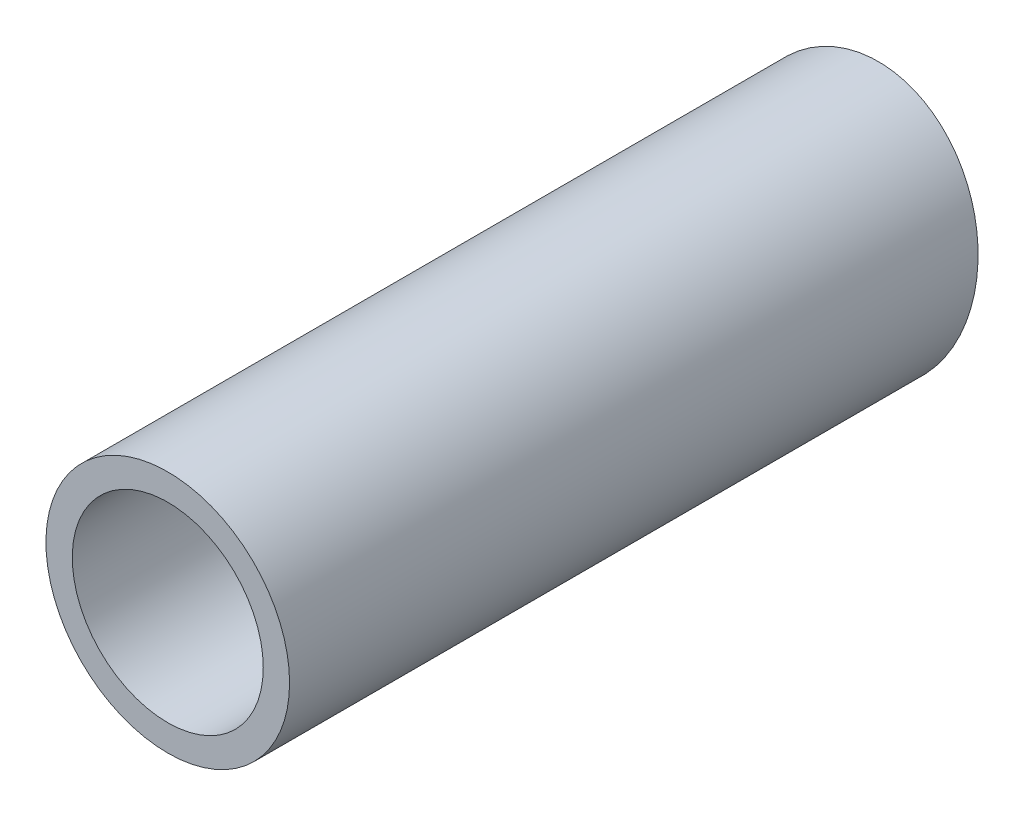
ISO-10303-21;
HEADER;
FILE_DESCRIPTION(('STEP AP214'),'2;1');
FILE_NAME('part.step','',(''),(''),'','','');
FILE_SCHEMA(('AUTOMOTIVE_DESIGN { 1 0 10303 214 1 1 1 1 }'));
ENDSEC;
DATA;
#1=APPLICATION_CONTEXT('core data for automotive mechanical design processes');
#2=APPLICATION_PROTOCOL_DEFINITION('international standard','automotive_design',2000,#1);
#3=PRODUCT_CONTEXT('',#1,'mechanical');
#4=PRODUCT('Part','Part','',(#3));
#5=PRODUCT_RELATED_PRODUCT_CATEGORY('part','',(#4));
#6=PRODUCT_DEFINITION_FORMATION('','',#4);
#7=PRODUCT_DEFINITION_CONTEXT('part definition',#1,'design');
#8=PRODUCT_DEFINITION('design','',#6,#7);
#9=PRODUCT_DEFINITION_SHAPE('','',#8);
#10=(LENGTH_UNIT() NAMED_UNIT(*) SI_UNIT(.MILLI.,.METRE.));
#11=(NAMED_UNIT(*) PLANE_ANGLE_UNIT() SI_UNIT($,.RADIAN.));
#12=(NAMED_UNIT(*) SI_UNIT($,.STERADIAN.) SOLID_ANGLE_UNIT());
#13=UNCERTAINTY_MEASURE_WITH_UNIT(LENGTH_MEASURE(1.E-05),#10,'distance_accuracy_value','');
#14=(GEOMETRIC_REPRESENTATION_CONTEXT(3) GLOBAL_UNCERTAINTY_ASSIGNED_CONTEXT((#13)) GLOBAL_UNIT_ASSIGNED_CONTEXT((#10,
#11,#12)) REPRESENTATION_CONTEXT('',''));
#15=CARTESIAN_POINT('',(0.,0.,0.));
#16=DIRECTION('',(0.,0.,1.));
#17=DIRECTION('',(1.,0.,0.));
#18=AXIS2_PLACEMENT_3D('',#15,#16,#17);
#19=CARTESIAN_POINT('',(0.,0.,60.));
#20=DIRECTION('',(0.,0.,1.));
#21=DIRECTION('',(1.,0.,0.));
#22=AXIS2_PLACEMENT_3D('',#19,#20,#21);
#23=PLANE('',#22);
#24=CARTESIAN_POINT('',(0.,0.,60.));
#25=DIRECTION('',(0.,0.,-1.));
#26=DIRECTION('',(-1.,0.,0.));
#27=AXIS2_PLACEMENT_3D('',#24,#25,#26);
#28=CIRCLE('',#27,10.65);
#29=CARTESIAN_POINT('',(10.65,0.,60.));
#30=VERTEX_POINT('',#29);
#31=EDGE_CURVE('E11',#30,#30,#28,.T.);
#32=ORIENTED_EDGE('',*,*,#31,.F.);
#33=EDGE_LOOP('',(#32));
#34=FACE_BOUND('',#33,.T.);
#35=CARTESIAN_POINT('',(0.,0.,60.));
#36=DIRECTION('',(0.,0.,1.));
#37=DIRECTION('',(-1.,0.,0.));
#38=AXIS2_PLACEMENT_3D('',#35,#36,#37);
#39=CIRCLE('',#38,8.35);
#40=CARTESIAN_POINT('',(8.35,0.,60.));
#41=VERTEX_POINT('',#40);
#42=EDGE_CURVE('E26',#41,#41,#39,.T.);
#43=ORIENTED_EDGE('',*,*,#42,.F.);
#44=EDGE_LOOP('',(#43));
#45=FACE_BOUND('',#44,.T.);
#46=ADVANCED_FACE('F16',(#34,#45),#23,.T.);
#47=CARTESIAN_POINT('',(0.,0.,0.));
#48=DIRECTION('',(0.,0.,1.));
#49=DIRECTION('',(-1.,0.,0.));
#50=AXIS2_PLACEMENT_3D('',#47,#48,#49);
#51=CYLINDRICAL_SURFACE('',#50,10.65);
#52=ORIENTED_EDGE('',*,*,#31,.T.);
#53=EDGE_LOOP('',(#52));
#54=FACE_BOUND('',#53,.T.);
#55=CARTESIAN_POINT('',(0.,0.,0.00404325115347778));
#56=DIRECTION('',(-0.000990516549095599,0.196301111783344,0.980543161920774));
#57=DIRECTION('',(-0.00494766359651267,0.980530679282665,-0.196303610793105));
#58=AXIS2_PLACEMENT_3D('',#55,#56,#57);
#59=ELLIPSE('',#58,10.8613270823671,10.65);
#60=CARTESIAN_POINT('',(0.0537381926152463,-10.6498644219847,2.13616097542709));
#61=VERTEX_POINT('',#60);
#62=EDGE_CURVE('E54',#61,#61,#59,.T.);
#63=ORIENTED_EDGE('',*,*,#62,.T.);
#64=EDGE_LOOP('',(#63));
#65=FACE_BOUND('',#64,.T.);
#66=ADVANCED_FACE('F91',(#54,#65),#51,.T.);
#67=CARTESIAN_POINT('',(0.,0.,0.));
#68=DIRECTION('',(0.,0.,1.));
#69=DIRECTION('',(-1.,0.,0.));
#70=AXIS2_PLACEMENT_3D('',#67,#68,#69);
#71=CYLINDRICAL_SURFACE('',#70,8.35);
#72=ORIENTED_EDGE('',*,*,#42,.T.);
#73=EDGE_LOOP('',(#72));
#74=FACE_BOUND('',#73,.T.);
#75=CARTESIAN_POINT('',(0.,0.,0.00404325115347778));
#76=DIRECTION('',(0.000990516549095599,-0.196301111783344,-0.980543161920774));
#77=DIRECTION('',(-0.00494766359651267,0.980530679282665,-0.196303610793105));
#78=AXIS2_PLACEMENT_3D('',#75,#76,#77);
#79=ELLIPSE('',#78,8.51568836974325,8.35);
#80=CARTESIAN_POINT('',(0.0421327613462239,-8.34989370174384,1.67570362652293));
#81=VERTEX_POINT('',#80);
#82=EDGE_CURVE('E20',#81,#81,#79,.T.);
#83=ORIENTED_EDGE('',*,*,#82,.T.);
#84=EDGE_LOOP('',(#83));
#85=FACE_BOUND('',#84,.T.);
#86=ADVANCED_FACE('F18',(#74,#85),#71,.F.);
#87=CARTESIAN_POINT('',(-3.92698434915245E-06,0.000778251907449975,0.00388744403518259));
#88=DIRECTION('',(-0.0009905165490956,0.196301111783344,0.980543161920774));
#89=DIRECTION('',(0.99998726966992,0.00504583968218271,0.));
#90=AXIS2_PLACEMENT_3D('',#87,#88,#89);
#91=PLANE('',#90);
#92=ORIENTED_EDGE('',*,*,#62,.F.);
#93=EDGE_LOOP('',(#92));
#94=FACE_BOUND('',#93,.T.);
#95=ORIENTED_EDGE('',*,*,#82,.F.);
#96=EDGE_LOOP('',(#95));
#97=FACE_BOUND('',#96,.T.);
#98=ADVANCED_FACE('F73',(#94,#97),#91,.F.);
#99=CLOSED_SHELL('',(#46,#66,#86,#98));
#100=MANIFOLD_SOLID_BREP('B1',#99);
#101=ADVANCED_BREP_SHAPE_REPRESENTATION('',(#18,#100),#14);
#102=SHAPE_DEFINITION_REPRESENTATION(#9,#101);
ENDSEC;
END-ISO-10303-21;
